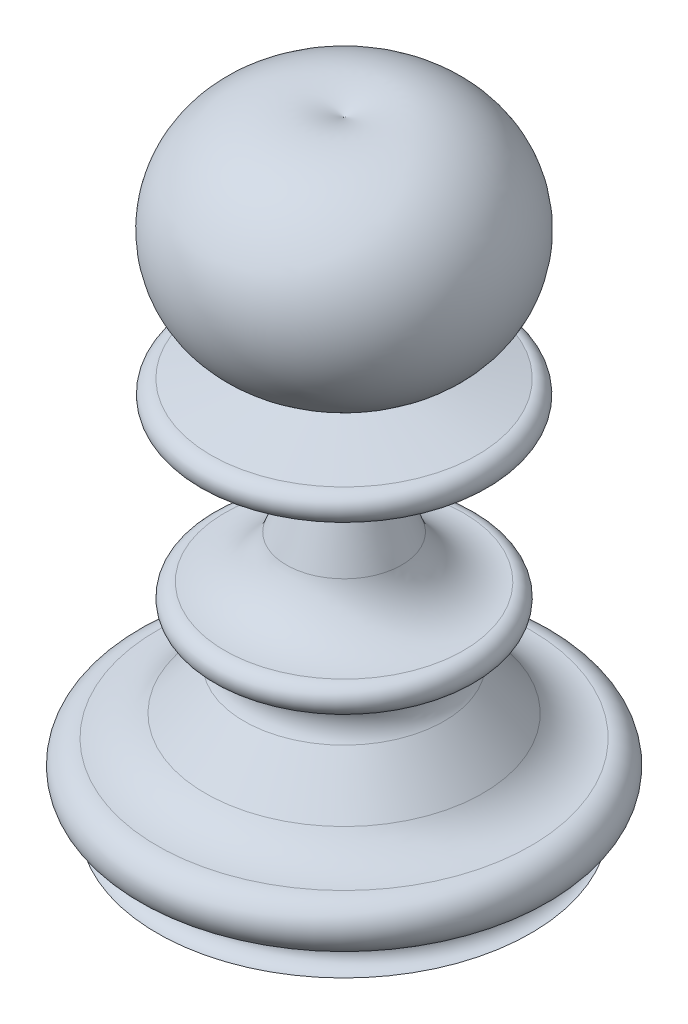
ISO-10303-21;
HEADER;
FILE_DESCRIPTION(('STEP AP214'),'2;1');
FILE_NAME('part.step','',(''),(''),'','','');
FILE_SCHEMA(('AUTOMOTIVE_DESIGN { 1 0 10303 214 1 1 1 1 }'));
ENDSEC;
DATA;
#1=APPLICATION_CONTEXT('core data for automotive mechanical design processes');
#2=APPLICATION_PROTOCOL_DEFINITION('international standard','automotive_design',2000,#1);
#3=PRODUCT_CONTEXT('',#1,'mechanical');
#4=PRODUCT('Part','Part','',(#3));
#5=PRODUCT_RELATED_PRODUCT_CATEGORY('part','',(#4));
#6=PRODUCT_DEFINITION_FORMATION('','',#4);
#7=PRODUCT_DEFINITION_CONTEXT('part definition',#1,'design');
#8=PRODUCT_DEFINITION('design','',#6,#7);
#9=PRODUCT_DEFINITION_SHAPE('','',#8);
#10=(LENGTH_UNIT() NAMED_UNIT(*) SI_UNIT(.MILLI.,.METRE.));
#11=(NAMED_UNIT(*) PLANE_ANGLE_UNIT() SI_UNIT($,.RADIAN.));
#12=(NAMED_UNIT(*) SI_UNIT($,.STERADIAN.) SOLID_ANGLE_UNIT());
#13=UNCERTAINTY_MEASURE_WITH_UNIT(LENGTH_MEASURE(1.E-05),#10,'distance_accuracy_value','');
#14=(GEOMETRIC_REPRESENTATION_CONTEXT(3) GLOBAL_UNCERTAINTY_ASSIGNED_CONTEXT((#13)) GLOBAL_UNIT_ASSIGNED_CONTEXT((#10,
#11,#12)) REPRESENTATION_CONTEXT('',''));
#15=CARTESIAN_POINT('',(0.,0.,0.));
#16=DIRECTION('',(0.,0.,1.));
#17=DIRECTION('',(1.,0.,0.));
#18=AXIS2_PLACEMENT_3D('',#15,#16,#17);
#19=CARTESIAN_POINT('',(0.,58.1242970582615,-4.68497803488356));
#20=DIRECTION('',(-1.,0.,0.));
#21=DIRECTION('',(0.,0.,-1.));
#22=AXIS2_PLACEMENT_3D('',#19,#20,#21);
#23=CIRCLE('',#22,11.9058025319637);
#24=TRIMMED_CURVE('',#23,(PARAMETER_VALUE(-1.97523606185763)),
(PARAMETER_VALUE(1.97523606185763)),.T.,.PARAMETER.);
#25=CARTESIAN_POINT('',(0.,58.1242970582615,0.));
#26=DIRECTION('',(0.,-1.,0.));
#27=AXIS1_PLACEMENT('',#25,#26);
#28=SURFACE_OF_REVOLUTION('',#24,#27);
#29=CARTESIAN_POINT('',(0.,46.5090624172376,0.));
#30=DIRECTION('',(0.,-1.,0.));
#31=DIRECTION('',(0.,0.,-1.));
#32=AXIS2_PLACEMENT_3D('',#29,#30,#31);
#33=CIRCLE('',#32,2.07069837041184);
#34=CARTESIAN_POINT('',(0.,46.5090624172376,-2.07069837041184));
#35=VERTEX_POINT('',#34);
#36=EDGE_CURVE('E11',#35,#35,#33,.T.);
#37=ORIENTED_EDGE('',*,*,#36,.F.);
#38=EDGE_LOOP('',(#37));
#39=FACE_BOUND('',#38,.T.);
#40=CARTESIAN_POINT('',(0.,69.069575252203,0.));
#41=VERTEX_POINT('',#40);
#42=VERTEX_LOOP('',#41);
#43=FACE_BOUND('',#42,.T.);
#44=ADVANCED_FACE('F39',(#39,#43),#28,.T.);
#45=CARTESIAN_POINT('',(0.,46.5090624172376,0.));
#46=DIRECTION('',(0.,-1.,0.));
#47=DIRECTION('',(0.,0.,-1.));
#48=AXIS2_PLACEMENT_3D('',#45,#46,#47);
#49=CONICAL_SURFACE('',#48,2.07069837041184,1.34941207874381);
#50=CARTESIAN_POINT('',(0.,43.6022602974658,0.));
#51=DIRECTION('',(0.,-1.,0.));
#52=DIRECTION('',(0.,0.,-1.));
#53=AXIS2_PLACEMENT_3D('',#50,#51,#52);
#54=CIRCLE('',#53,14.9856091716622);
#55=CARTESIAN_POINT('',(0.,43.6022602974658,-14.9856091716622));
#56=VERTEX_POINT('',#55);
#57=EDGE_CURVE('E46',#56,#56,#54,.T.);
#58=ORIENTED_EDGE('',*,*,#57,.F.);
#59=EDGE_LOOP('',(#58));
#60=FACE_BOUND('',#59,.T.);
#61=ORIENTED_EDGE('',*,*,#36,.T.);
#62=EDGE_LOOP('',(#61));
#63=FACE_BOUND('',#62,.T.);
#64=ADVANCED_FACE('F50',(#60,#63),#49,.T.);
#65=CARTESIAN_POINT('',(0.,42.0470044223674,0.));
#66=DIRECTION('',(0.,-1.,0.));
#67=DIRECTION('',(0.,0.,-1.));
#68=AXIS2_PLACEMENT_3D('',#65,#66,#67);
#69=TOROIDAL_SURFACE('',#68,14.9856091716622,1.55525587509846);
#70=CARTESIAN_POINT('',(0.,40.4917485472689,0.));
#71=DIRECTION('',(0.,-1.,0.));
#72=DIRECTION('',(0.,0.,-1.));
#73=AXIS2_PLACEMENT_3D('',#70,#71,#72);
#74=CIRCLE('',#73,14.9856091716622);
#75=CARTESIAN_POINT('',(0.,40.4917485472689,-14.9856091716622));
#76=VERTEX_POINT('',#75);
#77=EDGE_CURVE('E153',#76,#76,#74,.T.);
#78=ORIENTED_EDGE('',*,*,#77,.F.);
#79=EDGE_LOOP('',(#78));
#80=FACE_BOUND('',#79,.T.);
#81=ORIENTED_EDGE('',*,*,#57,.T.);
#82=EDGE_LOOP('',(#81));
#83=FACE_BOUND('',#82,.T.);
#84=ADVANCED_FACE('F55',(#80,#83),#69,.T.);
#85=CARTESIAN_POINT('',(-4.70038620328786,40.4917485472689,0.));
#86=DIRECTION('',(0.,1.,0.));
#87=DIRECTION('',(0.,0.,1.));
#88=AXIS2_PLACEMENT_3D('',#85,#86,#87);
#89=PLANE('',#88);
#90=CARTESIAN_POINT('',(0.,40.4917485472689,0.));
#91=DIRECTION('',(0.,-1.,0.));
#92=DIRECTION('',(0.,0.,-1.));
#93=AXIS2_PLACEMENT_3D('',#90,#91,#92);
#94=CIRCLE('',#93,4.70038620328786);
#95=CARTESIAN_POINT('',(0.,40.4917485472689,-4.70038620328786));
#96=VERTEX_POINT('',#95);
#97=EDGE_CURVE('E149',#96,#96,#94,.T.);
#98=ORIENTED_EDGE('',*,*,#97,.F.);
#99=EDGE_LOOP('',(#98));
#100=FACE_BOUND('',#99,.T.);
#101=ORIENTED_EDGE('',*,*,#77,.T.);
#102=EDGE_LOOP('',(#101));
#103=FACE_BOUND('',#102,.T.);
#104=ADVANCED_FACE('F62',(#100,#103),#89,.F.);
#105=CARTESIAN_POINT('',(0.,0.,0.));
#106=DIRECTION('',(0.,-1.,0.));
#107=DIRECTION('',(0.,0.,-1.));
#108=AXIS2_PLACEMENT_3D('',#105,#106,#107);
#109=CYLINDRICAL_SURFACE('',#108,4.70038620328786);
#110=CARTESIAN_POINT('',(0.,33.482536837034,0.));
#111=DIRECTION('',(0.,-1.,0.));
#112=DIRECTION('',(0.,0.,-1.));
#113=AXIS2_PLACEMENT_3D('',#110,#111,#112);
#114=CIRCLE('',#113,4.70038620328786);
#115=CARTESIAN_POINT('',(0.,33.482536837034,-4.70038620328786));
#116=VERTEX_POINT('',#115);
#117=EDGE_CURVE('E145',#116,#116,#114,.T.);
#118=ORIENTED_EDGE('',*,*,#117,.F.);
#119=EDGE_LOOP('',(#118));
#120=FACE_BOUND('',#119,.T.);
#121=ORIENTED_EDGE('',*,*,#97,.T.);
#122=EDGE_LOOP('',(#121));
#123=FACE_BOUND('',#122,.T.);
#124=ADVANCED_FACE('F69',(#120,#123),#109,.T.);
#125=CARTESIAN_POINT('',(0.,33.482536837034,0.));
#126=DIRECTION('',(0.,-1.,0.));
#127=DIRECTION('',(0.,0.,-1.));
#128=AXIS2_PLACEMENT_3D('',#125,#126,#127);
#129=CONICAL_SURFACE('',#128,4.70038620328786,0.351493387730024);
#130=CARTESIAN_POINT('',(0.,28.6329224996432,0.));
#131=DIRECTION('',(0.,-1.,0.));
#132=DIRECTION('',(0.,0.,-1.));
#133=AXIS2_PLACEMENT_3D('',#130,#131,#132);
#134=CIRCLE('',#133,6.4788454758839);
#135=CARTESIAN_POINT('',(0.,28.6329224996432,-6.4788454758839));
#136=VERTEX_POINT('',#135);
#137=EDGE_CURVE('E141',#136,#136,#134,.T.);
#138=ORIENTED_EDGE('',*,*,#137,.F.);
#139=EDGE_LOOP('',(#138));
#140=FACE_BOUND('',#139,.T.);
#141=ORIENTED_EDGE('',*,*,#117,.T.);
#142=EDGE_LOOP('',(#141));
#143=FACE_BOUND('',#142,.T.);
#144=ADVANCED_FACE('F73',(#140,#143),#129,.T.);
#145=CARTESIAN_POINT('',(0.,31.1849434483853,0.));
#146=DIRECTION('',(0.,-1.,0.));
#147=DIRECTION('',(0.,0.,-1.));
#148=AXIS2_PLACEMENT_3D('',#145,#146,#147);
#149=TOROIDAL_SURFACE('',#148,13.4378563304173,7.41219555842475);
#150=CARTESIAN_POINT('',(0.,23.7727478899605,0.));
#151=DIRECTION('',(0.,-1.,0.));
#152=DIRECTION('',(0.,0.,-1.));
#153=AXIS2_PLACEMENT_3D('',#150,#151,#152);
#154=CIRCLE('',#153,13.4378563304173);
#155=CARTESIAN_POINT('',(0.,23.7727478899605,-13.4378563304173));
#156=VERTEX_POINT('',#155);
#157=EDGE_CURVE('E137',#156,#156,#154,.T.);
#158=ORIENTED_EDGE('',*,*,#157,.F.);
#159=EDGE_LOOP('',(#158));
#160=FACE_BOUND('',#159,.T.);
#161=ORIENTED_EDGE('',*,*,#137,.T.);
#162=EDGE_LOOP('',(#161));
#163=FACE_BOUND('',#162,.T.);
#164=ADVANCED_FACE('F77',(#160,#163),#149,.F.);
#165=CARTESIAN_POINT('',(0.,22.2249950487156,0.));
#166=DIRECTION('',(0.,-1.,0.));
#167=DIRECTION('',(0.,0.,-1.));
#168=AXIS2_PLACEMENT_3D('',#165,#166,#167);
#169=TOROIDAL_SURFACE('',#168,13.4378563304173,1.54775284124497);
#170=CARTESIAN_POINT('',(0.,20.6772422074706,0.));
#171=DIRECTION('',(0.,-1.,0.));
#172=DIRECTION('',(0.,0.,-1.));
#173=AXIS2_PLACEMENT_3D('',#170,#171,#172);
#174=CIRCLE('',#173,13.4378563304173);
#175=CARTESIAN_POINT('',(0.,20.6772422074706,-13.4378563304173));
#176=VERTEX_POINT('',#175);
#177=EDGE_CURVE('E133',#176,#176,#174,.T.);
#178=ORIENTED_EDGE('',*,*,#177,.F.);
#179=EDGE_LOOP('',(#178));
#180=FACE_BOUND('',#179,.T.);
#181=ORIENTED_EDGE('',*,*,#157,.T.);
#182=EDGE_LOOP('',(#181));
#183=FACE_BOUND('',#182,.T.);
#184=ADVANCED_FACE('F81',(#180,#183),#169,.T.);
#185=CARTESIAN_POINT('',(0.,17.750552708151,0.));
#186=DIRECTION('',(0.,-1.,0.));
#187=DIRECTION('',(0.,0.,-1.));
#188=AXIS2_PLACEMENT_3D('',#185,#186,#187);
#189=TOROIDAL_SURFACE('',#188,13.4378563304173,2.92668949931957);
#190=CARTESIAN_POINT('',(0.,15.7957340550767,0.));
#191=DIRECTION('',(0.,-1.,0.));
#192=DIRECTION('',(0.,0.,-1.));
#193=AXIS2_PLACEMENT_3D('',#190,#191,#192);
#194=CIRCLE('',#193,11.2597389187472);
#195=CARTESIAN_POINT('',(0.,15.7957340550767,-11.2597389187472));
#196=VERTEX_POINT('',#195);
#197=EDGE_CURVE('E129',#196,#196,#194,.T.);
#198=ORIENTED_EDGE('',*,*,#197,.F.);
#199=EDGE_LOOP('',(#198));
#200=FACE_BOUND('',#199,.T.);
#201=ORIENTED_EDGE('',*,*,#177,.T.);
#202=EDGE_LOOP('',(#201));
#203=FACE_BOUND('',#202,.T.);
#204=ADVANCED_FACE('F85',(#200,#203),#189,.F.);
#205=CARTESIAN_POINT('',(0.,15.7957340550767,0.));
#206=DIRECTION('',(0.,-1.,0.));
#207=DIRECTION('',(0.,0.,-1.));
#208=AXIS2_PLACEMENT_3D('',#205,#206,#207);
#209=CONICAL_SURFACE('',#208,11.2597389187472,0.731421558243143);
#210=CARTESIAN_POINT('',(0.,10.9418869203983,0.));
#211=DIRECTION('',(0.,-1.,0.));
#212=DIRECTION('',(0.,0.,-1.));
#213=AXIS2_PLACEMENT_3D('',#210,#211,#212);
#214=CIRCLE('',#213,15.6159737420873);
#215=CARTESIAN_POINT('',(0.,10.9418869203983,-15.6159737420873));
#216=VERTEX_POINT('',#215);
#217=EDGE_CURVE('E125',#216,#216,#214,.T.);
#218=ORIENTED_EDGE('',*,*,#217,.F.);
#219=EDGE_LOOP('',(#218));
#220=FACE_BOUND('',#219,.T.);
#221=ORIENTED_EDGE('',*,*,#197,.T.);
#222=EDGE_LOOP('',(#221));
#223=FACE_BOUND('',#222,.T.);
#224=ADVANCED_FACE('F89',(#220,#223),#209,.T.);
#225=CARTESIAN_POINT('',(0.,15.7957340550767,0.));
#226=DIRECTION('',(0.,-1.,0.));
#227=DIRECTION('',(0.,0.,-1.));
#228=AXIS2_PLACEMENT_3D('',#225,#226,#227);
#229=TOROIDAL_SURFACE('',#228,21.0242753975894,7.26701856360179);
#230=CARTESIAN_POINT('',(0.,8.52871549147495,0.));
#231=DIRECTION('',(0.,-1.,0.));
#232=DIRECTION('',(0.,0.,-1.));
#233=AXIS2_PLACEMENT_3D('',#230,#231,#232);
#234=CIRCLE('',#233,21.0242753975894);
#235=CARTESIAN_POINT('',(0.,8.52871549147495,-21.0242753975894));
#236=VERTEX_POINT('',#235);
#237=EDGE_CURVE('E119',#236,#236,#234,.T.);
#238=ORIENTED_EDGE('',*,*,#237,.F.);
#239=EDGE_LOOP('',(#238));
#240=FACE_BOUND('',#239,.T.);
#241=ORIENTED_EDGE('',*,*,#217,.T.);
#242=EDGE_LOOP('',(#241));
#243=FACE_BOUND('',#242,.T.);
#244=ADVANCED_FACE('F93',(#240,#243),#229,.F.);
#245=CARTESIAN_POINT('',(0.,5.85109551159328,0.));
#246=DIRECTION('',(0.,-1.,0.));
#247=DIRECTION('',(0.,0.,-1.));
#248=AXIS2_PLACEMENT_3D('',#245,#246,#247);
#249=TOROIDAL_SURFACE('',#248,21.0242753975894,2.67761997988167);
#250=CARTESIAN_POINT('',(0.,3.17347553171161,0.));
#251=DIRECTION('',(0.,-1.,0.));
#252=DIRECTION('',(0.,0.,-1.));
#253=AXIS2_PLACEMENT_3D('',#250,#251,#252);
#254=CIRCLE('',#253,21.0242753975894);
#255=CARTESIAN_POINT('',(0.,3.17347553171161,-21.0242753975894));
#256=VERTEX_POINT('',#255);
#257=EDGE_CURVE('E115',#256,#256,#254,.T.);
#258=ORIENTED_EDGE('',*,*,#257,.F.);
#259=EDGE_LOOP('',(#258));
#260=FACE_BOUND('',#259,.T.);
#261=ORIENTED_EDGE('',*,*,#237,.T.);
#262=EDGE_LOOP('',(#261));
#263=FACE_BOUND('',#262,.T.);
#264=ADVANCED_FACE('F97',(#260,#263),#249,.T.);
#265=CARTESIAN_POINT('',(0.,1.58673776585581,0.));
#266=DIRECTION('',(0.,-1.,0.));
#267=DIRECTION('',(0.,0.,-1.));
#268=AXIS2_PLACEMENT_3D('',#265,#266,#267);
#269=TOROIDAL_SURFACE('',#268,21.0242753975894,1.58673776585581);
#270=CARTESIAN_POINT('',(0.,0.,0.));
#271=DIRECTION('',(0.,-1.,0.));
#272=DIRECTION('',(0.,0.,-1.));
#273=AXIS2_PLACEMENT_3D('',#270,#271,#272);
#274=CIRCLE('',#273,21.0242753975894);
#275=CARTESIAN_POINT('',(0.,0.,-21.0242753975894));
#276=VERTEX_POINT('',#275);
#277=EDGE_CURVE('E113',#276,#276,#274,.T.);
#278=ORIENTED_EDGE('',*,*,#277,.F.);
#279=EDGE_LOOP('',(#278));
#280=FACE_BOUND('',#279,.T.);
#281=ORIENTED_EDGE('',*,*,#257,.T.);
#282=EDGE_LOOP('',(#281));
#283=FACE_BOUND('',#282,.T.);
#284=ADVANCED_FACE('F101',(#280,#283),#269,.F.);
#285=CARTESIAN_POINT('',(0.,0.,0.));
#286=DIRECTION('',(0.,1.,0.));
#287=DIRECTION('',(0.,0.,1.));
#288=AXIS2_PLACEMENT_3D('',#285,#286,#287);
#289=PLANE('',#288);
#290=ORIENTED_EDGE('',*,*,#277,.T.);
#291=EDGE_LOOP('',(#290));
#292=FACE_BOUND('',#291,.T.);
#293=ADVANCED_FACE('F105',(#292),#289,.F.);
#294=CLOSED_SHELL('',(#44,#64,#84,#104,#124,#144,#164,#184,#204,#224,#244,#264,#284,#293));
#295=MANIFOLD_SOLID_BREP('B2',#294);
#296=ADVANCED_BREP_SHAPE_REPRESENTATION('',(#18,#295),#14);
#297=SHAPE_DEFINITION_REPRESENTATION(#9,#296);
ENDSEC;
END-ISO-10303-21;
